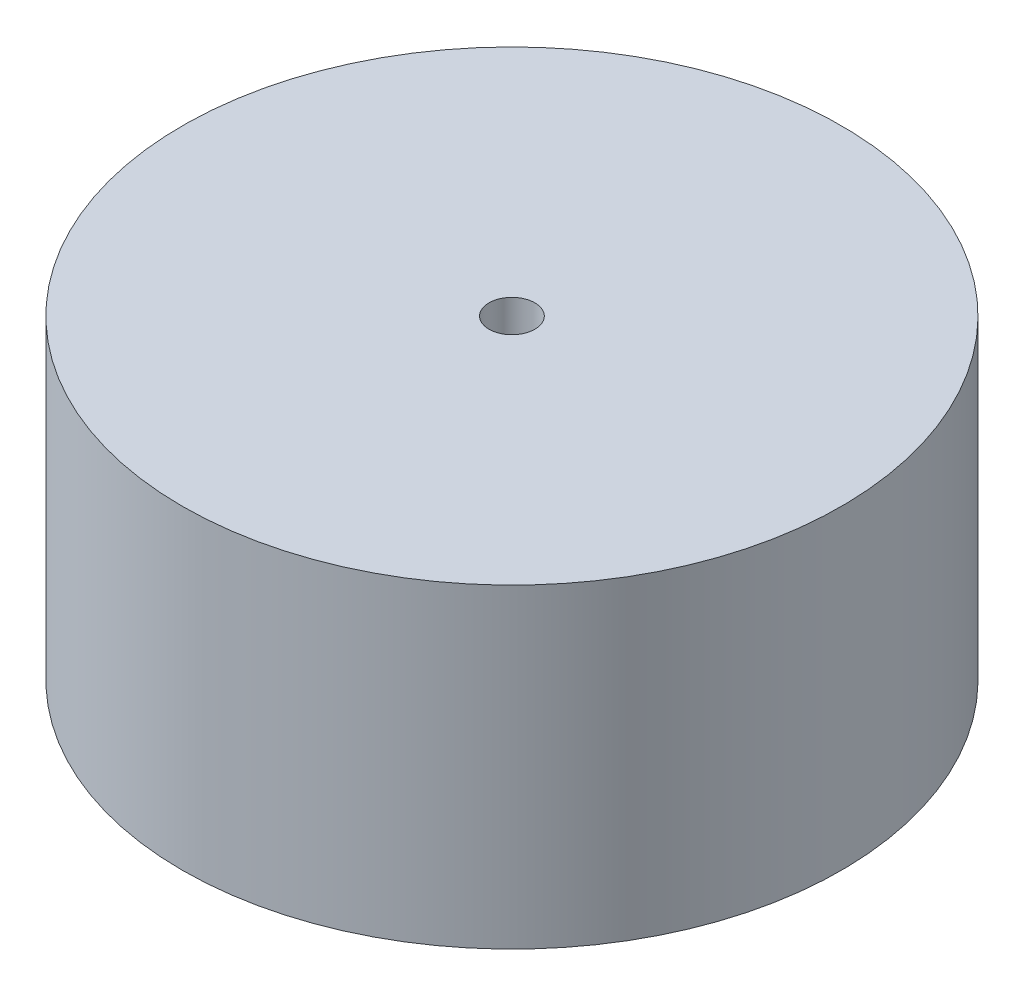
ISO-10303-21;
HEADER;
FILE_DESCRIPTION(('STEP AP214'),'2;1');
FILE_NAME('part.step','',(''),(''),'','','');
FILE_SCHEMA(('AUTOMOTIVE_DESIGN { 1 0 10303 214 1 1 1 1 }'));
ENDSEC;
DATA;
#1=APPLICATION_CONTEXT('core data for automotive mechanical design processes');
#2=APPLICATION_PROTOCOL_DEFINITION('international standard','automotive_design',2000,#1);
#3=PRODUCT_CONTEXT('',#1,'mechanical');
#4=PRODUCT('Part','Part','',(#3));
#5=PRODUCT_RELATED_PRODUCT_CATEGORY('part','',(#4));
#6=PRODUCT_DEFINITION_FORMATION('','',#4);
#7=PRODUCT_DEFINITION_CONTEXT('part definition',#1,'design');
#8=PRODUCT_DEFINITION('design','',#6,#7);
#9=PRODUCT_DEFINITION_SHAPE('','',#8);
#10=(LENGTH_UNIT() NAMED_UNIT(*) SI_UNIT(.MILLI.,.METRE.));
#11=(NAMED_UNIT(*) PLANE_ANGLE_UNIT() SI_UNIT($,.RADIAN.));
#12=(NAMED_UNIT(*) SI_UNIT($,.STERADIAN.) SOLID_ANGLE_UNIT());
#13=UNCERTAINTY_MEASURE_WITH_UNIT(LENGTH_MEASURE(1.E-05),#10,'distance_accuracy_value','');
#14=(GEOMETRIC_REPRESENTATION_CONTEXT(3) GLOBAL_UNCERTAINTY_ASSIGNED_CONTEXT((#13)) GLOBAL_UNIT_ASSIGNED_CONTEXT((#10,
#11,#12)) REPRESENTATION_CONTEXT('',''));
#15=CARTESIAN_POINT('',(0.,0.,0.));
#16=DIRECTION('',(0.,0.,1.));
#17=DIRECTION('',(1.,0.,0.));
#18=AXIS2_PLACEMENT_3D('',#15,#16,#17);
#19=CARTESIAN_POINT('',(0.,22.,0.));
#20=DIRECTION('',(0.,-1.,0.));
#21=DIRECTION('',(0.,0.,-1.));
#22=AXIS2_PLACEMENT_3D('',#19,#20,#21);
#23=CYLINDRICAL_SURFACE('',#22,23.);
#24=CARTESIAN_POINT('',(0.,22.,0.));
#25=DIRECTION('',(0.,1.,0.));
#26=DIRECTION('',(0.,0.,1.));
#27=AXIS2_PLACEMENT_3D('',#24,#25,#26);
#28=CIRCLE('',#27,23.);
#29=CARTESIAN_POINT('',(0.,22.,23.));
#30=VERTEX_POINT('',#29);
#31=EDGE_CURVE('E10',#30,#30,#28,.T.);
#32=ORIENTED_EDGE('',*,*,#31,.F.);
#33=EDGE_LOOP('',(#32));
#34=FACE_BOUND('',#33,.T.);
#35=CARTESIAN_POINT('',(0.,0.,0.));
#36=DIRECTION('',(0.,1.,0.));
#37=DIRECTION('',(0.,0.,1.));
#38=AXIS2_PLACEMENT_3D('',#35,#36,#37);
#39=CIRCLE('',#38,23.);
#40=CARTESIAN_POINT('',(0.,0.,23.));
#41=VERTEX_POINT('',#40);
#42=EDGE_CURVE('E44',#41,#41,#39,.T.);
#43=ORIENTED_EDGE('',*,*,#42,.T.);
#44=EDGE_LOOP('',(#43));
#45=FACE_BOUND('',#44,.T.);
#46=ADVANCED_FACE('F41',(#34,#45),#23,.T.);
#47=CARTESIAN_POINT('',(0.,22.,0.));
#48=DIRECTION('',(0.,1.,0.));
#49=DIRECTION('',(0.,0.,1.));
#50=AXIS2_PLACEMENT_3D('',#47,#48,#49);
#51=PLANE('',#50);
#52=CARTESIAN_POINT('',(0.,22.,0.));
#53=DIRECTION('',(0.,1.,0.));
#54=DIRECTION('',(0.,0.,1.));
#55=AXIS2_PLACEMENT_3D('',#52,#53,#54);
#56=CIRCLE('',#55,1.6);
#57=CARTESIAN_POINT('',(0.,22.,1.6));
#58=VERTEX_POINT('',#57);
#59=EDGE_CURVE('E51',#58,#58,#56,.T.);
#60=ORIENTED_EDGE('',*,*,#59,.F.);
#61=EDGE_LOOP('',(#60));
#62=FACE_BOUND('',#61,.T.);
#63=ORIENTED_EDGE('',*,*,#31,.T.);
#64=EDGE_LOOP('',(#63));
#65=FACE_BOUND('',#64,.T.);
#66=ADVANCED_FACE('F69',(#62,#65),#51,.T.);
#67=CARTESIAN_POINT('',(0.,0.,0.));
#68=DIRECTION('',(0.,1.,0.));
#69=DIRECTION('',(0.,0.,1.));
#70=AXIS2_PLACEMENT_3D('',#67,#68,#69);
#71=PLANE('',#70);
#72=CARTESIAN_POINT('',(0.,0.,0.));
#73=DIRECTION('',(0.,1.,0.));
#74=DIRECTION('',(0.,0.,1.));
#75=AXIS2_PLACEMENT_3D('',#72,#73,#74);
#76=CIRCLE('',#75,1.6);
#77=CARTESIAN_POINT('',(0.,0.,1.6));
#78=VERTEX_POINT('',#77);
#79=EDGE_CURVE('E55',#78,#78,#76,.T.);
#80=ORIENTED_EDGE('',*,*,#79,.T.);
#81=EDGE_LOOP('',(#80));
#82=FACE_BOUND('',#81,.T.);
#83=ORIENTED_EDGE('',*,*,#42,.F.);
#84=EDGE_LOOP('',(#83));
#85=FACE_BOUND('',#84,.T.);
#86=ADVANCED_FACE('F59',(#82,#85),#71,.F.);
#87=CARTESIAN_POINT('',(0.,0.,0.));
#88=DIRECTION('',(0.,1.,0.));
#89=DIRECTION('',(0.,0.,1.));
#90=AXIS2_PLACEMENT_3D('',#87,#88,#89);
#91=CYLINDRICAL_SURFACE('',#90,1.6);
#92=ORIENTED_EDGE('',*,*,#59,.T.);
#93=EDGE_LOOP('',(#92));
#94=FACE_BOUND('',#93,.T.);
#95=ORIENTED_EDGE('',*,*,#79,.F.);
#96=EDGE_LOOP('',(#95));
#97=FACE_BOUND('',#96,.T.);
#98=ADVANCED_FACE('F62',(#94,#97),#91,.F.);
#99=CLOSED_SHELL('',(#46,#66,#86,#98));
#100=MANIFOLD_SOLID_BREP('B2',#99);
#101=ADVANCED_BREP_SHAPE_REPRESENTATION('',(#18,#100),#14);
#102=SHAPE_DEFINITION_REPRESENTATION(#9,#101);
ENDSEC;
END-ISO-10303-21;
